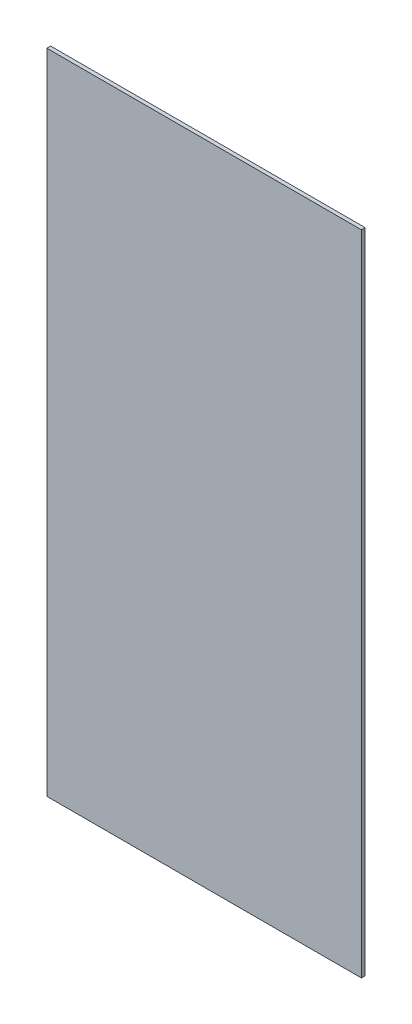
ISO-10303-21;
HEADER;
FILE_DESCRIPTION(('STEP AP214'),'2;1');
FILE_NAME('part.step','',(''),(''),'','','');
FILE_SCHEMA(('AUTOMOTIVE_DESIGN { 1 0 10303 214 1 1 1 1 }'));
ENDSEC;
DATA;
#1=APPLICATION_CONTEXT('core data for automotive mechanical design processes');
#2=APPLICATION_PROTOCOL_DEFINITION('international standard','automotive_design',2000,#1);
#3=PRODUCT_CONTEXT('',#1,'mechanical');
#4=PRODUCT('Part','Part','',(#3));
#5=PRODUCT_RELATED_PRODUCT_CATEGORY('part','',(#4));
#6=PRODUCT_DEFINITION_FORMATION('','',#4);
#7=PRODUCT_DEFINITION_CONTEXT('part definition',#1,'design');
#8=PRODUCT_DEFINITION('design','',#6,#7);
#9=PRODUCT_DEFINITION_SHAPE('','',#8);
#10=(LENGTH_UNIT() NAMED_UNIT(*) SI_UNIT(.MILLI.,.METRE.));
#11=(NAMED_UNIT(*) PLANE_ANGLE_UNIT() SI_UNIT($,.RADIAN.));
#12=(NAMED_UNIT(*) SI_UNIT($,.STERADIAN.) SOLID_ANGLE_UNIT());
#13=UNCERTAINTY_MEASURE_WITH_UNIT(LENGTH_MEASURE(1.E-05),#10,'distance_accuracy_value','');
#14=(GEOMETRIC_REPRESENTATION_CONTEXT(3) GLOBAL_UNCERTAINTY_ASSIGNED_CONTEXT((#13)) GLOBAL_UNIT_ASSIGNED_CONTEXT((#10,
#11,#12)) REPRESENTATION_CONTEXT('',''));
#15=CARTESIAN_POINT('',(0.,0.,0.));
#16=DIRECTION('',(0.,0.,1.));
#17=DIRECTION('',(1.,0.,0.));
#18=AXIS2_PLACEMENT_3D('',#15,#16,#17);
#19=CARTESIAN_POINT('',(126.25,260.,3.));
#20=DIRECTION('',(-1.,0.,0.));
#21=DIRECTION('',(0.,-1.,0.));
#22=AXIS2_PLACEMENT_3D('',#19,#20,#21);
#23=PLANE('',#22);
#24=DIRECTION('',(0.,1.,0.));
#25=VECTOR('',#24,1.);
#26=CARTESIAN_POINT('',(126.25,260.,0.));
#27=LINE('',#26,#25);
#28=CARTESIAN_POINT('',(126.25,-260.,0.));
#29=VERTEX_POINT('',#28);
#30=CARTESIAN_POINT('',(126.25,260.,0.));
#31=VERTEX_POINT('',#30);
#32=EDGE_CURVE('E96',#29,#31,#27,.T.);
#33=ORIENTED_EDGE('',*,*,#32,.T.);
#34=DIRECTION('',(0.,0.,-1.));
#35=VECTOR('',#34,1.);
#36=CARTESIAN_POINT('',(126.25,260.,3.));
#37=LINE('',#36,#35);
#38=CARTESIAN_POINT('',(126.25,260.,3.));
#39=VERTEX_POINT('',#38);
#40=EDGE_CURVE('E11',#39,#31,#37,.T.);
#41=ORIENTED_EDGE('',*,*,#40,.F.);
#42=DIRECTION('',(0.,1.,0.));
#43=VECTOR('',#42,1.);
#44=CARTESIAN_POINT('',(126.25,260.,3.));
#45=LINE('',#44,#43);
#46=CARTESIAN_POINT('',(126.25,-260.,3.));
#47=VERTEX_POINT('',#46);
#48=EDGE_CURVE('E84',#47,#39,#45,.T.);
#49=ORIENTED_EDGE('',*,*,#48,.F.);
#50=DIRECTION('',(0.,0.,-1.));
#51=VECTOR('',#50,1.);
#52=CARTESIAN_POINT('',(126.25,-260.,3.));
#53=LINE('',#52,#51);
#54=EDGE_CURVE('E92',#47,#29,#53,.T.);
#55=ORIENTED_EDGE('',*,*,#54,.T.);
#56=EDGE_LOOP('',(#33,#41,#49,#55));
#57=FACE_BOUND('',#56,.T.);
#58=ADVANCED_FACE('F33',(#57),#23,.F.);
#59=CARTESIAN_POINT('',(-126.25,260.,3.));
#60=DIRECTION('',(0.,-1.,0.));
#61=DIRECTION('',(0.,0.,-1.));
#62=AXIS2_PLACEMENT_3D('',#59,#60,#61);
#63=PLANE('',#62);
#64=DIRECTION('',(-1.,0.,0.));
#65=VECTOR('',#64,1.);
#66=CARTESIAN_POINT('',(-126.25,260.,0.));
#67=LINE('',#66,#65);
#68=CARTESIAN_POINT('',(-126.25,260.,0.));
#69=VERTEX_POINT('',#68);
#70=EDGE_CURVE('E88',#31,#69,#67,.T.);
#71=ORIENTED_EDGE('',*,*,#70,.T.);
#72=DIRECTION('',(0.,0.,-1.));
#73=VECTOR('',#72,1.);
#74=CARTESIAN_POINT('',(-126.25,260.,3.));
#75=LINE('',#74,#73);
#76=CARTESIAN_POINT('',(-126.25,260.,3.));
#77=VERTEX_POINT('',#76);
#78=EDGE_CURVE('E41',#77,#69,#75,.T.);
#79=ORIENTED_EDGE('',*,*,#78,.F.);
#80=DIRECTION('',(-1.,0.,0.));
#81=VECTOR('',#80,1.);
#82=CARTESIAN_POINT('',(-126.25,260.,3.));
#83=LINE('',#82,#81);
#84=EDGE_CURVE('E79',#39,#77,#83,.T.);
#85=ORIENTED_EDGE('',*,*,#84,.F.);
#86=ORIENTED_EDGE('',*,*,#40,.T.);
#87=EDGE_LOOP('',(#71,#79,#85,#86));
#88=FACE_BOUND('',#87,.T.);
#89=ADVANCED_FACE('F87',(#88),#63,.F.);
#90=CARTESIAN_POINT('',(-126.25,260.,3.));
#91=DIRECTION('',(1.,0.,0.));
#92=DIRECTION('',(0.,1.,0.));
#93=AXIS2_PLACEMENT_3D('',#90,#91,#92);
#94=PLANE('',#93);
#95=DIRECTION('',(0.,-1.,0.));
#96=VECTOR('',#95,1.);
#97=CARTESIAN_POINT('',(-126.25,260.,0.));
#98=LINE('',#97,#96);
#99=CARTESIAN_POINT('',(-126.25,-260.,0.));
#100=VERTEX_POINT('',#99);
#101=EDGE_CURVE('E66',#69,#100,#98,.T.);
#102=ORIENTED_EDGE('',*,*,#101,.T.);
#103=DIRECTION('',(0.,0.,-1.));
#104=VECTOR('',#103,1.);
#105=CARTESIAN_POINT('',(-126.25,-260.,3.));
#106=LINE('',#105,#104);
#107=CARTESIAN_POINT('',(-126.25,-260.,3.));
#108=VERTEX_POINT('',#107);
#109=EDGE_CURVE('E89',#108,#100,#106,.T.);
#110=ORIENTED_EDGE('',*,*,#109,.F.);
#111=DIRECTION('',(0.,-1.,0.));
#112=VECTOR('',#111,1.);
#113=CARTESIAN_POINT('',(-126.25,260.,3.));
#114=LINE('',#113,#112);
#115=EDGE_CURVE('E82',#77,#108,#114,.T.);
#116=ORIENTED_EDGE('',*,*,#115,.F.);
#117=ORIENTED_EDGE('',*,*,#78,.T.);
#118=EDGE_LOOP('',(#102,#110,#116,#117));
#119=FACE_BOUND('',#118,.T.);
#120=ADVANCED_FACE('F90',(#119),#94,.F.);
#121=CARTESIAN_POINT('',(-126.25,-260.,3.));
#122=DIRECTION('',(0.,1.,0.));
#123=DIRECTION('',(0.,0.,1.));
#124=AXIS2_PLACEMENT_3D('',#121,#122,#123);
#125=PLANE('',#124);
#126=DIRECTION('',(1.,0.,0.));
#127=VECTOR('',#126,1.);
#128=CARTESIAN_POINT('',(-126.25,-260.,0.));
#129=LINE('',#128,#127);
#130=EDGE_CURVE('E72',#100,#29,#129,.T.);
#131=ORIENTED_EDGE('',*,*,#130,.T.);
#132=ORIENTED_EDGE('',*,*,#54,.F.);
#133=DIRECTION('',(1.,0.,0.));
#134=VECTOR('',#133,1.);
#135=CARTESIAN_POINT('',(-126.25,-260.,3.));
#136=LINE('',#135,#134);
#137=EDGE_CURVE('E49',#108,#47,#136,.T.);
#138=ORIENTED_EDGE('',*,*,#137,.F.);
#139=ORIENTED_EDGE('',*,*,#109,.T.);
#140=EDGE_LOOP('',(#131,#132,#138,#139));
#141=FACE_BOUND('',#140,.T.);
#142=ADVANCED_FACE('F103',(#141),#125,.F.);
#143=CARTESIAN_POINT('',(0.,0.,3.));
#144=DIRECTION('',(0.,0.,1.));
#145=DIRECTION('',(1.,0.,0.));
#146=AXIS2_PLACEMENT_3D('',#143,#144,#145);
#147=PLANE('',#146);
#148=ORIENTED_EDGE('',*,*,#48,.T.);
#149=ORIENTED_EDGE('',*,*,#84,.T.);
#150=ORIENTED_EDGE('',*,*,#115,.T.);
#151=ORIENTED_EDGE('',*,*,#137,.T.);
#152=EDGE_LOOP('',(#148,#149,#150,#151));
#153=FACE_BOUND('',#152,.T.);
#154=ADVANCED_FACE('F80',(#153),#147,.T.);
#155=CARTESIAN_POINT('',(0.,0.,0.));
#156=DIRECTION('',(0.,0.,1.));
#157=DIRECTION('',(1.,0.,0.));
#158=AXIS2_PLACEMENT_3D('',#155,#156,#157);
#159=PLANE('',#158);
#160=ORIENTED_EDGE('',*,*,#32,.F.);
#161=ORIENTED_EDGE('',*,*,#130,.F.);
#162=ORIENTED_EDGE('',*,*,#101,.F.);
#163=ORIENTED_EDGE('',*,*,#70,.F.);
#164=EDGE_LOOP('',(#160,#161,#162,#163));
#165=FACE_BOUND('',#164,.T.);
#166=ADVANCED_FACE('F106',(#165),#159,.F.);
#167=CLOSED_SHELL('',(#58,#89,#120,#142,#154,#166));
#168=MANIFOLD_SOLID_BREP('B2',#167);
#169=ADVANCED_BREP_SHAPE_REPRESENTATION('',(#18,#168),#14);
#170=SHAPE_DEFINITION_REPRESENTATION(#9,#169);
ENDSEC;
END-ISO-10303-21;
